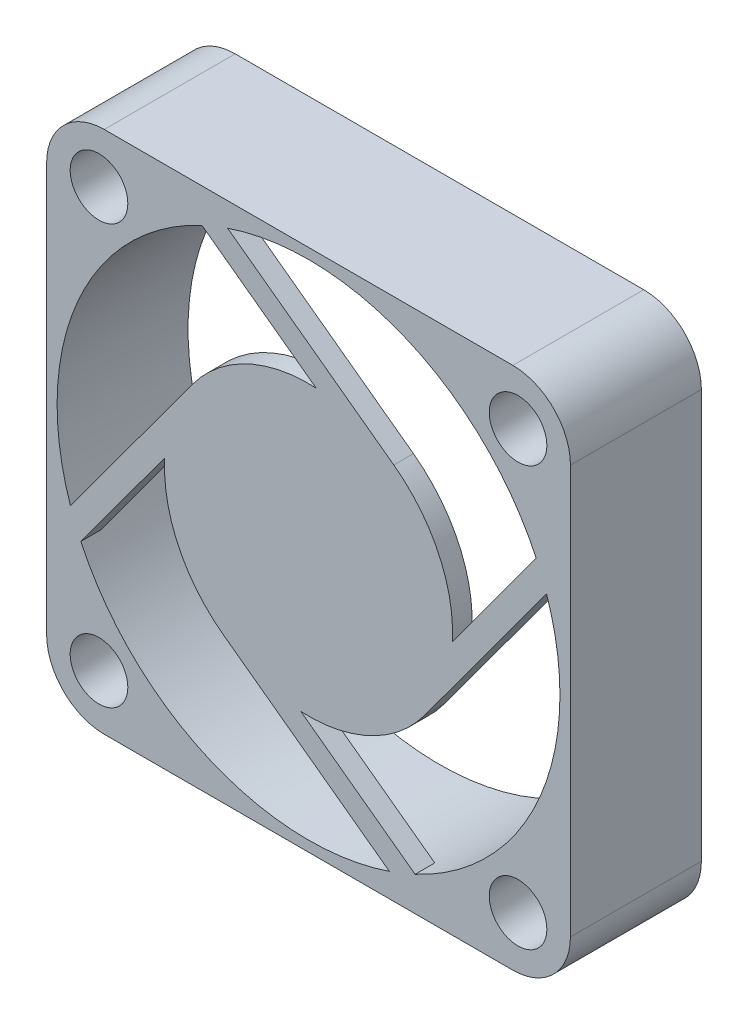
ISO-10303-21;
HEADER;
FILE_DESCRIPTION(('STEP AP214'),'2;1');
FILE_NAME('part.step','',(''),(''),'','','');
FILE_SCHEMA(('AUTOMOTIVE_DESIGN { 1 0 10303 214 1 1 1 1 }'));
ENDSEC;
DATA;
#1=APPLICATION_CONTEXT('core data for automotive mechanical design processes');
#2=APPLICATION_PROTOCOL_DEFINITION('international standard','automotive_design',2000,#1);
#3=PRODUCT_CONTEXT('',#1,'mechanical');
#4=PRODUCT('Part','Part','',(#3));
#5=PRODUCT_RELATED_PRODUCT_CATEGORY('part','',(#4));
#6=PRODUCT_DEFINITION_FORMATION('','',#4);
#7=PRODUCT_DEFINITION_CONTEXT('part definition',#1,'design');
#8=PRODUCT_DEFINITION('design','',#6,#7);
#9=PRODUCT_DEFINITION_SHAPE('','',#8);
#10=(LENGTH_UNIT() NAMED_UNIT(*) SI_UNIT(.MILLI.,.METRE.));
#11=(NAMED_UNIT(*) PLANE_ANGLE_UNIT() SI_UNIT($,.RADIAN.));
#12=(NAMED_UNIT(*) SI_UNIT($,.STERADIAN.) SOLID_ANGLE_UNIT());
#13=UNCERTAINTY_MEASURE_WITH_UNIT(LENGTH_MEASURE(1.E-05),#10,'distance_accuracy_value','');
#14=(GEOMETRIC_REPRESENTATION_CONTEXT(3) GLOBAL_UNCERTAINTY_ASSIGNED_CONTEXT((#13)) GLOBAL_UNIT_ASSIGNED_CONTEXT((#10,
#11,#12)) REPRESENTATION_CONTEXT('',''));
#15=CARTESIAN_POINT('',(0.,0.,0.));
#16=DIRECTION('',(0.,0.,1.));
#17=DIRECTION('',(1.,0.,0.));
#18=AXIS2_PLACEMENT_3D('',#15,#16,#17);
#19=CARTESIAN_POINT('',(-20.,20.,10.));
#20=DIRECTION('',(1.,0.,0.));
#21=DIRECTION('',(0.,1.,0.));
#22=AXIS2_PLACEMENT_3D('',#19,#20,#21);
#23=PLANE('',#22);
#24=DIRECTION('',(0.,-1.,0.));
#25=VECTOR('',#24,1.);
#26=CARTESIAN_POINT('',(-20.,20.,0.));
#27=LINE('',#26,#25);
#28=CARTESIAN_POINT('',(-20.,15.6,0.));
#29=VERTEX_POINT('',#28);
#30=CARTESIAN_POINT('',(-20.,-15.6,0.));
#31=VERTEX_POINT('',#30);
#32=EDGE_CURVE('E421',#29,#31,#27,.T.);
#33=ORIENTED_EDGE('',*,*,#32,.T.);
#34=DIRECTION('',(0.,0.,-1.));
#35=VECTOR('',#34,1.);
#36=CARTESIAN_POINT('',(-20.,-15.6,10.));
#37=LINE('',#36,#35);
#38=CARTESIAN_POINT('',(-20.,-15.6,10.));
#39=VERTEX_POINT('',#38);
#40=EDGE_CURVE('E489',#31,#39,#37,.F.);
#41=ORIENTED_EDGE('',*,*,#40,.T.);
#42=DIRECTION('',(0.,-1.,0.));
#43=VECTOR('',#42,1.);
#44=CARTESIAN_POINT('',(-20.,20.,10.));
#45=LINE('',#44,#43);
#46=CARTESIAN_POINT('',(-20.,15.6,10.));
#47=VERTEX_POINT('',#46);
#48=EDGE_CURVE('E425',#47,#39,#45,.T.);
#49=ORIENTED_EDGE('',*,*,#48,.F.);
#50=DIRECTION('',(0.,0.,-1.));
#51=VECTOR('',#50,1.);
#52=CARTESIAN_POINT('',(-20.,15.6,10.));
#53=LINE('',#52,#51);
#54=EDGE_CURVE('E485',#47,#29,#53,.T.);
#55=ORIENTED_EDGE('',*,*,#54,.T.);
#56=EDGE_LOOP('',(#33,#41,#49,#55));
#57=FACE_BOUND('',#56,.T.);
#58=ADVANCED_FACE('F40',(#57),#23,.F.);
#59=CARTESIAN_POINT('',(20.,-20.,10.));
#60=DIRECTION('',(0.,1.,0.));
#61=DIRECTION('',(-1.,0.,0.));
#62=AXIS2_PLACEMENT_3D('',#59,#60,#61);
#63=PLANE('',#62);
#64=DIRECTION('',(1.,0.,0.));
#65=VECTOR('',#64,1.);
#66=CARTESIAN_POINT('',(20.,-20.,0.));
#67=LINE('',#66,#65);
#68=CARTESIAN_POINT('',(-15.6,-20.,0.));
#69=VERTEX_POINT('',#68);
#70=CARTESIAN_POINT('',(15.6,-20.,0.));
#71=VERTEX_POINT('',#70);
#72=EDGE_CURVE('E445',#69,#71,#67,.T.);
#73=ORIENTED_EDGE('',*,*,#72,.T.);
#74=DIRECTION('',(0.,0.,-1.));
#75=VECTOR('',#74,1.);
#76=CARTESIAN_POINT('',(15.6,-20.,10.));
#77=LINE('',#76,#75);
#78=CARTESIAN_POINT('',(15.6,-20.,10.));
#79=VERTEX_POINT('',#78);
#80=EDGE_CURVE('E473',#71,#79,#77,.F.);
#81=ORIENTED_EDGE('',*,*,#80,.T.);
#82=DIRECTION('',(1.,0.,0.));
#83=VECTOR('',#82,1.);
#84=CARTESIAN_POINT('',(20.,-20.,10.));
#85=LINE('',#84,#83);
#86=CARTESIAN_POINT('',(-15.6,-20.,10.));
#87=VERTEX_POINT('',#86);
#88=EDGE_CURVE('E429',#87,#79,#85,.T.);
#89=ORIENTED_EDGE('',*,*,#88,.F.);
#90=DIRECTION('',(0.,0.,-1.));
#91=VECTOR('',#90,1.);
#92=CARTESIAN_POINT('',(-15.6,-20.,10.));
#93=LINE('',#92,#91);
#94=EDGE_CURVE('E470',#87,#69,#93,.T.);
#95=ORIENTED_EDGE('',*,*,#94,.T.);
#96=EDGE_LOOP('',(#73,#81,#89,#95));
#97=FACE_BOUND('',#96,.T.);
#98=ADVANCED_FACE('F520',(#97),#63,.F.);
#99=CARTESIAN_POINT('',(20.,20.,10.));
#100=DIRECTION('',(-1.,0.,0.));
#101=DIRECTION('',(0.,-1.,0.));
#102=AXIS2_PLACEMENT_3D('',#99,#100,#101);
#103=PLANE('',#102);
#104=DIRECTION('',(0.,1.,0.));
#105=VECTOR('',#104,1.);
#106=CARTESIAN_POINT('',(20.,20.,10.));
#107=LINE('',#106,#105);
#108=CARTESIAN_POINT('',(20.,-15.6,10.));
#109=VERTEX_POINT('',#108);
#110=CARTESIAN_POINT('',(20.,15.6,10.));
#111=VERTEX_POINT('',#110);
#112=EDGE_CURVE('E433',#109,#111,#107,.T.);
#113=ORIENTED_EDGE('',*,*,#112,.F.);
#114=DIRECTION('',(0.,0.,-1.));
#115=VECTOR('',#114,1.);
#116=CARTESIAN_POINT('',(20.,-15.6,10.));
#117=LINE('',#116,#115);
#118=CARTESIAN_POINT('',(20.,-15.6,0.));
#119=VERTEX_POINT('',#118);
#120=EDGE_CURVE('E457',#109,#119,#117,.T.);
#121=ORIENTED_EDGE('',*,*,#120,.T.);
#122=DIRECTION('',(0.,1.,0.));
#123=VECTOR('',#122,1.);
#124=CARTESIAN_POINT('',(20.,20.,0.));
#125=LINE('',#124,#123);
#126=CARTESIAN_POINT('',(20.,15.6,0.));
#127=VERTEX_POINT('',#126);
#128=EDGE_CURVE('E448',#119,#127,#125,.T.);
#129=ORIENTED_EDGE('',*,*,#128,.T.);
#130=DIRECTION('',(0.,0.,-1.));
#131=VECTOR('',#130,1.);
#132=CARTESIAN_POINT('',(20.,15.6,10.));
#133=LINE('',#132,#131);
#134=EDGE_CURVE('E441',#127,#111,#133,.F.);
#135=ORIENTED_EDGE('',*,*,#134,.T.);
#136=EDGE_LOOP('',(#113,#121,#129,#135));
#137=FACE_BOUND('',#136,.T.);
#138=ADVANCED_FACE('F528',(#137),#103,.F.);
#139=CARTESIAN_POINT('',(20.,20.,10.));
#140=DIRECTION('',(0.,-1.,0.));
#141=DIRECTION('',(1.,0.,0.));
#142=AXIS2_PLACEMENT_3D('',#139,#140,#141);
#143=PLANE('',#142);
#144=DIRECTION('',(-1.,0.,0.));
#145=VECTOR('',#144,1.);
#146=CARTESIAN_POINT('',(20.,20.,0.));
#147=LINE('',#146,#145);
#148=CARTESIAN_POINT('',(15.6,20.,0.));
#149=VERTEX_POINT('',#148);
#150=CARTESIAN_POINT('',(-15.6,20.,0.));
#151=VERTEX_POINT('',#150);
#152=EDGE_CURVE('E430',#149,#151,#147,.T.);
#153=ORIENTED_EDGE('',*,*,#152,.T.);
#154=DIRECTION('',(0.,0.,-1.));
#155=VECTOR('',#154,1.);
#156=CARTESIAN_POINT('',(-15.6,20.,10.));
#157=LINE('',#156,#155);
#158=CARTESIAN_POINT('',(-15.6,20.,10.));
#159=VERTEX_POINT('',#158);
#160=EDGE_CURVE('E11',#151,#159,#157,.F.);
#161=ORIENTED_EDGE('',*,*,#160,.T.);
#162=DIRECTION('',(-1.,0.,0.));
#163=VECTOR('',#162,1.);
#164=CARTESIAN_POINT('',(20.,20.,10.));
#165=LINE('',#164,#163);
#166=CARTESIAN_POINT('',(15.6,20.,10.));
#167=VERTEX_POINT('',#166);
#168=EDGE_CURVE('E437',#167,#159,#165,.T.);
#169=ORIENTED_EDGE('',*,*,#168,.F.);
#170=DIRECTION('',(0.,0.,-1.));
#171=VECTOR('',#170,1.);
#172=CARTESIAN_POINT('',(15.6,20.,10.));
#173=LINE('',#172,#171);
#174=EDGE_CURVE('E49',#167,#149,#173,.T.);
#175=ORIENTED_EDGE('',*,*,#174,.T.);
#176=EDGE_LOOP('',(#153,#161,#169,#175));
#177=FACE_BOUND('',#176,.T.);
#178=ADVANCED_FACE('F496',(#177),#143,.F.);
#179=CARTESIAN_POINT('',(-20.,-20.,10.));
#180=DIRECTION('',(0.,0.,-1.));
#181=DIRECTION('',(-1.,0.,0.));
#182=AXIS2_PLACEMENT_3D('',#179,#180,#181);
#183=PLANE('',#182);
#184=CARTESIAN_POINT('',(0.,0.,10.));
#185=DIRECTION('',(0.,0.,1.));
#186=DIRECTION('',(1.,0.,0.));
#187=AXIS2_PLACEMENT_3D('',#184,#185,#186);
#188=CIRCLE('',#187,19.2);
#189=CARTESIAN_POINT('',(8.13981859572141,-17.3891734486935,10.));
#190=VERTEX_POINT('',#189);
#191=CARTESIAN_POINT('',(18.1798437537984,6.17521506406682,10.));
#192=VERTEX_POINT('',#191);
#193=EDGE_CURVE('E344',#190,#192,#188,.T.);
#194=ORIENTED_EDGE('',*,*,#193,.F.);
#195=DIRECTION('',(-0.806084681412893,0.5918002081712,0.));
#196=VECTOR('',#195,1.);
#197=CARTESIAN_POINT('',(-0.583931442200631,-10.984490159803,10.));
#198=LINE('',#197,#196);
#199=CARTESIAN_POINT('',(-0.583931442200632,-10.984490159803,10.));
#200=VERTEX_POINT('',#199);
#201=EDGE_CURVE('E309',#190,#200,#198,.T.);
#202=ORIENTED_EDGE('',*,*,#201,.T.);
#203=CARTESIAN_POINT('',(0.,0.,10.));
#204=DIRECTION('',(0.,0.,1.));
#205=DIRECTION('',(1.,0.,0.));
#206=AXIS2_PLACEMENT_3D('',#203,#204,#205);
#207=CIRCLE('',#206,11.);
#208=CARTESIAN_POINT('',(8.8669314955418,-6.50980228988323,10.));
#209=VERTEX_POINT('',#208);
#210=EDGE_CURVE('E312',#200,#209,#207,.T.);
#211=ORIENTED_EDGE('',*,*,#210,.T.);
#212=DIRECTION('',(0.591800208171203,0.80608468141289,0.));
#213=VECTOR('',#212,1.);
#214=CARTESIAN_POINT('',(8.8669314955418,-6.50980228988323,10.));
#215=LINE('',#214,#213);
#216=EDGE_CURVE('E315',#209,#192,#215,.T.);
#217=ORIENTED_EDGE('',*,*,#216,.T.);
#218=EDGE_LOOP('',(#194,#202,#211,#217));
#219=FACE_BOUND('',#218,.T.);
#220=CARTESIAN_POINT('',(-17.3891734486935,-8.1398185957214,10.));
#221=VERTEX_POINT('',#220);
#222=CARTESIAN_POINT('',(6.17521506406676,-18.1798437537984,10.));
#223=VERTEX_POINT('',#222);
#224=EDGE_CURVE('E396',#221,#223,#188,.T.);
#225=ORIENTED_EDGE('',*,*,#224,.F.);
#226=DIRECTION('',(0.5918002081712,0.806084681412893,0.));
#227=VECTOR('',#226,1.);
#228=CARTESIAN_POINT('',(-10.984490159803,0.583931442200646,10.));
#229=LINE('',#228,#227);
#230=CARTESIAN_POINT('',(-10.984490159803,0.583931442200646,10.));
#231=VERTEX_POINT('',#230);
#232=EDGE_CURVE('E252',#221,#231,#229,.T.);
#233=ORIENTED_EDGE('',*,*,#232,.T.);
#234=CARTESIAN_POINT('',(0.,0.,10.));
#235=DIRECTION('',(0.,0.,1.));
#236=DIRECTION('',(1.,0.,0.));
#237=AXIS2_PLACEMENT_3D('',#234,#235,#236);
#238=CIRCLE('',#237,11.);
#239=CARTESIAN_POINT('',(-6.50980228988326,-8.86693149554177,10.));
#240=VERTEX_POINT('',#239);
#241=EDGE_CURVE('E306',#231,#240,#238,.T.);
#242=ORIENTED_EDGE('',*,*,#241,.T.);
#243=DIRECTION('',(0.806084681412888,-0.591800208171206,0.));
#244=VECTOR('',#243,1.);
#245=CARTESIAN_POINT('',(-6.50980228988326,-8.86693149554177,10.));
#246=LINE('',#245,#244);
#247=EDGE_CURVE('E234',#240,#223,#246,.T.);
#248=ORIENTED_EDGE('',*,*,#247,.T.);
#249=EDGE_LOOP('',(#225,#233,#242,#248));
#250=FACE_BOUND('',#249,.T.);
#251=CARTESIAN_POINT('',(-8.13981859572126,17.3891734486936,10.));
#252=VERTEX_POINT('',#251);
#253=CARTESIAN_POINT('',(-18.1798437537984,-6.17521506406669,10.));
#254=VERTEX_POINT('',#253);
#255=EDGE_CURVE('E826',#252,#254,#188,.T.);
#256=ORIENTED_EDGE('',*,*,#255,.F.);
#257=DIRECTION('',(0.806084681412886,-0.591800208171208,0.));
#258=VECTOR('',#257,1.);
#259=CARTESIAN_POINT('',(0.583931442200696,10.984490159803,10.));
#260=LINE('',#259,#258);
#261=CARTESIAN_POINT('',(0.583931442200694,10.984490159803,10.));
#262=VERTEX_POINT('',#261);
#263=EDGE_CURVE('E331',#252,#262,#260,.T.);
#264=ORIENTED_EDGE('',*,*,#263,.T.);
#265=CARTESIAN_POINT('',(0.,0.,10.));
#266=DIRECTION('',(0.,0.,1.));
#267=DIRECTION('',(1.,0.,0.));
#268=AXIS2_PLACEMENT_3D('',#265,#266,#267);
#269=CIRCLE('',#268,11.);
#270=CARTESIAN_POINT('',(-8.86693149554175,6.50980228988329,10.));
#271=VERTEX_POINT('',#270);
#272=EDGE_CURVE('E335',#262,#271,#269,.T.);
#273=ORIENTED_EDGE('',*,*,#272,.T.);
#274=DIRECTION('',(-0.591800208171208,-0.806084681412886,0.));
#275=VECTOR('',#274,1.);
#276=CARTESIAN_POINT('',(-8.86693149554175,6.50980228988329,10.));
#277=LINE('',#276,#275);
#278=EDGE_CURVE('E258',#271,#254,#277,.T.);
#279=ORIENTED_EDGE('',*,*,#278,.T.);
#280=EDGE_LOOP('',(#256,#264,#273,#279));
#281=FACE_BOUND('',#280,.T.);
#282=CARTESIAN_POINT('',(17.3891734486936,8.13981859572132,10.));
#283=VERTEX_POINT('',#282);
#284=CARTESIAN_POINT('',(-6.17521506406688,18.1798437537984,10.));
#285=VERTEX_POINT('',#284);
#286=EDGE_CURVE('E393',#283,#285,#188,.T.);
#287=ORIENTED_EDGE('',*,*,#286,.F.);
#288=DIRECTION('',(-0.5918002081712,-0.806084681412892,0.));
#289=VECTOR('',#288,1.);
#290=CARTESIAN_POINT('',(10.984490159803,-0.583931442200781,10.));
#291=LINE('',#290,#289);
#292=CARTESIAN_POINT('',(10.984490159803,-0.583931442200779,10.));
#293=VERTEX_POINT('',#292);
#294=EDGE_CURVE('E319',#283,#293,#291,.T.);
#295=ORIENTED_EDGE('',*,*,#294,.T.);
#296=CARTESIAN_POINT('',(0.,0.,10.));
#297=DIRECTION('',(0.,0.,1.));
#298=DIRECTION('',(1.,0.,0.));
#299=AXIS2_PLACEMENT_3D('',#296,#297,#298);
#300=CIRCLE('',#299,11.);
#301=CARTESIAN_POINT('',(6.5098022898832,8.86693149554182,10.));
#302=VERTEX_POINT('',#301);
#303=EDGE_CURVE('E323',#293,#302,#300,.T.);
#304=ORIENTED_EDGE('',*,*,#303,.T.);
#305=DIRECTION('',(-0.806084681412893,0.5918002081712,0.));
#306=VECTOR('',#305,1.);
#307=CARTESIAN_POINT('',(6.5098022898832,8.86693149554182,10.));
#308=LINE('',#307,#306);
#309=EDGE_CURVE('E327',#302,#285,#308,.T.);
#310=ORIENTED_EDGE('',*,*,#309,.T.);
#311=EDGE_LOOP('',(#287,#295,#304,#310));
#312=FACE_BOUND('',#311,.T.);
#313=CARTESIAN_POINT('',(-16.,-16.,10.));
#314=DIRECTION('',(0.,0.,1.));
#315=DIRECTION('',(1.,0.,0.));
#316=AXIS2_PLACEMENT_3D('',#313,#314,#315);
#317=CIRCLE('',#316,2.2);
#318=CARTESIAN_POINT('',(-13.8,-16.,10.));
#319=VERTEX_POINT('',#318);
#320=EDGE_CURVE('E392',#319,#319,#317,.T.);
#321=ORIENTED_EDGE('',*,*,#320,.F.);
#322=EDGE_LOOP('',(#321));
#323=FACE_BOUND('',#322,.T.);
#324=CARTESIAN_POINT('',(16.,-16.,10.));
#325=DIRECTION('',(0.,0.,1.));
#326=DIRECTION('',(1.,0.,0.));
#327=AXIS2_PLACEMENT_3D('',#324,#325,#326);
#328=CIRCLE('',#327,2.2);
#329=CARTESIAN_POINT('',(18.2,-16.,10.));
#330=VERTEX_POINT('',#329);
#331=EDGE_CURVE('E400',#330,#330,#328,.T.);
#332=ORIENTED_EDGE('',*,*,#331,.F.);
#333=EDGE_LOOP('',(#332));
#334=FACE_BOUND('',#333,.T.);
#335=CARTESIAN_POINT('',(16.,16.,10.));
#336=DIRECTION('',(0.,0.,1.));
#337=DIRECTION('',(1.,0.,0.));
#338=AXIS2_PLACEMENT_3D('',#335,#336,#337);
#339=CIRCLE('',#338,2.2);
#340=CARTESIAN_POINT('',(18.2,16.,10.));
#341=VERTEX_POINT('',#340);
#342=EDGE_CURVE('E406',#341,#341,#339,.T.);
#343=ORIENTED_EDGE('',*,*,#342,.F.);
#344=EDGE_LOOP('',(#343));
#345=FACE_BOUND('',#344,.T.);
#346=CARTESIAN_POINT('',(-16.,16.,10.));
#347=DIRECTION('',(0.,0.,1.));
#348=DIRECTION('',(1.,0.,0.));
#349=AXIS2_PLACEMENT_3D('',#346,#347,#348);
#350=CIRCLE('',#349,2.2);
#351=CARTESIAN_POINT('',(-13.8,16.,10.));
#352=VERTEX_POINT('',#351);
#353=EDGE_CURVE('E413',#352,#352,#350,.T.);
#354=ORIENTED_EDGE('',*,*,#353,.F.);
#355=EDGE_LOOP('',(#354));
#356=FACE_BOUND('',#355,.T.);
#357=ORIENTED_EDGE('',*,*,#88,.T.);
#358=CARTESIAN_POINT('',(15.6,-15.6,10.));
#359=DIRECTION('',(0.,0.,-1.));
#360=DIRECTION('',(-1.,0.,0.));
#361=AXIS2_PLACEMENT_3D('',#358,#359,#360);
#362=CIRCLE('',#361,4.4);
#363=EDGE_CURVE('E483',#79,#109,#362,.F.);
#364=ORIENTED_EDGE('',*,*,#363,.T.);
#365=ORIENTED_EDGE('',*,*,#112,.T.);
#366=CARTESIAN_POINT('',(15.6,15.6,10.));
#367=DIRECTION('',(0.,0.,-1.));
#368=DIRECTION('',(-1.,0.,0.));
#369=AXIS2_PLACEMENT_3D('',#366,#367,#368);
#370=CIRCLE('',#369,4.4);
#371=EDGE_CURVE('E475',#111,#167,#370,.F.);
#372=ORIENTED_EDGE('',*,*,#371,.T.);
#373=ORIENTED_EDGE('',*,*,#168,.T.);
#374=CARTESIAN_POINT('',(-15.6,15.6,10.));
#375=DIRECTION('',(0.,0.,-1.));
#376=DIRECTION('',(-1.,0.,0.));
#377=AXIS2_PLACEMENT_3D('',#374,#375,#376);
#378=CIRCLE('',#377,4.4);
#379=EDGE_CURVE('E478',#159,#47,#378,.F.);
#380=ORIENTED_EDGE('',*,*,#379,.T.);
#381=ORIENTED_EDGE('',*,*,#48,.T.);
#382=CARTESIAN_POINT('',(-15.6,-15.6,10.));
#383=DIRECTION('',(0.,0.,-1.));
#384=DIRECTION('',(-1.,0.,0.));
#385=AXIS2_PLACEMENT_3D('',#382,#383,#384);
#386=CIRCLE('',#385,4.4);
#387=EDGE_CURVE('E481',#39,#87,#386,.F.);
#388=ORIENTED_EDGE('',*,*,#387,.T.);
#389=EDGE_LOOP('',(#357,#364,#365,#372,#373,#380,#381,#388));
#390=FACE_BOUND('',#389,.T.);
#391=ADVANCED_FACE('F513',(#219,#250,#281,#312,#323,#334,#345,#356,#390),#183,.F.);
#392=CARTESIAN_POINT('',(-20.,-20.,0.));
#393=DIRECTION('',(0.,0.,-1.));
#394=DIRECTION('',(-1.,0.,0.));
#395=AXIS2_PLACEMENT_3D('',#392,#393,#394);
#396=PLANE('',#395);
#397=CARTESIAN_POINT('',(0.,0.,0.));
#398=DIRECTION('',(0.,0.,1.));
#399=DIRECTION('',(1.,0.,0.));
#400=AXIS2_PLACEMENT_3D('',#397,#398,#399);
#401=CIRCLE('',#400,19.2);
#402=CARTESIAN_POINT('',(19.2,0.,0.));
#403=VERTEX_POINT('',#402);
#404=EDGE_CURVE('E388',#403,#403,#401,.T.);
#405=ORIENTED_EDGE('',*,*,#404,.T.);
#406=EDGE_LOOP('',(#405));
#407=FACE_BOUND('',#406,.T.);
#408=CARTESIAN_POINT('',(-16.,-16.,0.));
#409=DIRECTION('',(0.,0.,1.));
#410=DIRECTION('',(1.,0.,0.));
#411=AXIS2_PLACEMENT_3D('',#408,#409,#410);
#412=CIRCLE('',#411,2.2);
#413=CARTESIAN_POINT('',(-13.8,-16.,0.));
#414=VERTEX_POINT('',#413);
#415=EDGE_CURVE('E397',#414,#414,#412,.T.);
#416=ORIENTED_EDGE('',*,*,#415,.T.);
#417=EDGE_LOOP('',(#416));
#418=FACE_BOUND('',#417,.T.);
#419=CARTESIAN_POINT('',(16.,-16.,0.));
#420=DIRECTION('',(0.,0.,1.));
#421=DIRECTION('',(1.,0.,0.));
#422=AXIS2_PLACEMENT_3D('',#419,#420,#421);
#423=CIRCLE('',#422,2.2);
#424=CARTESIAN_POINT('',(18.2,-16.,0.));
#425=VERTEX_POINT('',#424);
#426=EDGE_CURVE('E403',#425,#425,#423,.T.);
#427=ORIENTED_EDGE('',*,*,#426,.T.);
#428=EDGE_LOOP('',(#427));
#429=FACE_BOUND('',#428,.T.);
#430=CARTESIAN_POINT('',(16.,16.,0.));
#431=DIRECTION('',(0.,0.,1.));
#432=DIRECTION('',(1.,0.,0.));
#433=AXIS2_PLACEMENT_3D('',#430,#431,#432);
#434=CIRCLE('',#433,2.2);
#435=CARTESIAN_POINT('',(18.2,16.,0.));
#436=VERTEX_POINT('',#435);
#437=EDGE_CURVE('E409',#436,#436,#434,.T.);
#438=ORIENTED_EDGE('',*,*,#437,.T.);
#439=EDGE_LOOP('',(#438));
#440=FACE_BOUND('',#439,.T.);
#441=CARTESIAN_POINT('',(-16.,16.,0.));
#442=DIRECTION('',(0.,0.,1.));
#443=DIRECTION('',(1.,0.,0.));
#444=AXIS2_PLACEMENT_3D('',#441,#442,#443);
#445=CIRCLE('',#444,2.2);
#446=CARTESIAN_POINT('',(-13.8,16.,0.));
#447=VERTEX_POINT('',#446);
#448=EDGE_CURVE('E417',#447,#447,#445,.T.);
#449=ORIENTED_EDGE('',*,*,#448,.T.);
#450=EDGE_LOOP('',(#449));
#451=FACE_BOUND('',#450,.T.);
#452=ORIENTED_EDGE('',*,*,#128,.F.);
#453=CARTESIAN_POINT('',(15.6,-15.6,0.));
#454=DIRECTION('',(0.,0.,-1.));
#455=DIRECTION('',(-1.,0.,0.));
#456=AXIS2_PLACEMENT_3D('',#453,#454,#455);
#457=CIRCLE('',#456,4.4);
#458=EDGE_CURVE('E468',#119,#71,#457,.T.);
#459=ORIENTED_EDGE('',*,*,#458,.T.);
#460=ORIENTED_EDGE('',*,*,#72,.F.);
#461=CARTESIAN_POINT('',(-15.6,-15.6,0.));
#462=DIRECTION('',(0.,0.,-1.));
#463=DIRECTION('',(-1.,0.,0.));
#464=AXIS2_PLACEMENT_3D('',#461,#462,#463);
#465=CIRCLE('',#464,4.4);
#466=EDGE_CURVE('E466',#69,#31,#465,.T.);
#467=ORIENTED_EDGE('',*,*,#466,.T.);
#468=ORIENTED_EDGE('',*,*,#32,.F.);
#469=CARTESIAN_POINT('',(-15.6,15.6,0.));
#470=DIRECTION('',(0.,0.,-1.));
#471=DIRECTION('',(-1.,0.,0.));
#472=AXIS2_PLACEMENT_3D('',#469,#470,#471);
#473=CIRCLE('',#472,4.4);
#474=EDGE_CURVE('E463',#29,#151,#473,.T.);
#475=ORIENTED_EDGE('',*,*,#474,.T.);
#476=ORIENTED_EDGE('',*,*,#152,.F.);
#477=CARTESIAN_POINT('',(15.6,15.6,0.));
#478=DIRECTION('',(0.,0.,-1.));
#479=DIRECTION('',(-1.,0.,0.));
#480=AXIS2_PLACEMENT_3D('',#477,#478,#479);
#481=CIRCLE('',#480,4.4);
#482=EDGE_CURVE('E460',#149,#127,#481,.T.);
#483=ORIENTED_EDGE('',*,*,#482,.T.);
#484=EDGE_LOOP('',(#452,#459,#460,#467,#468,#475,#476,#483));
#485=FACE_BOUND('',#484,.T.);
#486=ADVANCED_FACE('F502',(#407,#418,#429,#440,#451,#485),#396,.T.);
#487=CARTESIAN_POINT('',(-16.,16.,0.));
#488=DIRECTION('',(0.,0.,1.));
#489=DIRECTION('',(1.,0.,0.));
#490=AXIS2_PLACEMENT_3D('',#487,#488,#489);
#491=CYLINDRICAL_SURFACE('',#490,2.2);
#492=ORIENTED_EDGE('',*,*,#448,.F.);
#493=EDGE_LOOP('',(#492));
#494=FACE_BOUND('',#493,.T.);
#495=ORIENTED_EDGE('',*,*,#353,.T.);
#496=EDGE_LOOP('',(#495));
#497=FACE_BOUND('',#496,.T.);
#498=ADVANCED_FACE('F722',(#494,#497),#491,.F.);
#499=CARTESIAN_POINT('',(16.,16.,0.));
#500=DIRECTION('',(0.,0.,1.));
#501=DIRECTION('',(1.,0.,0.));
#502=AXIS2_PLACEMENT_3D('',#499,#500,#501);
#503=CYLINDRICAL_SURFACE('',#502,2.2);
#504=ORIENTED_EDGE('',*,*,#437,.F.);
#505=EDGE_LOOP('',(#504));
#506=FACE_BOUND('',#505,.T.);
#507=ORIENTED_EDGE('',*,*,#342,.T.);
#508=EDGE_LOOP('',(#507));
#509=FACE_BOUND('',#508,.T.);
#510=ADVANCED_FACE('F718',(#506,#509),#503,.F.);
#511=CARTESIAN_POINT('',(16.,-16.,0.));
#512=DIRECTION('',(0.,0.,1.));
#513=DIRECTION('',(1.,0.,0.));
#514=AXIS2_PLACEMENT_3D('',#511,#512,#513);
#515=CYLINDRICAL_SURFACE('',#514,2.2);
#516=ORIENTED_EDGE('',*,*,#426,.F.);
#517=EDGE_LOOP('',(#516));
#518=FACE_BOUND('',#517,.T.);
#519=ORIENTED_EDGE('',*,*,#331,.T.);
#520=EDGE_LOOP('',(#519));
#521=FACE_BOUND('',#520,.T.);
#522=ADVANCED_FACE('F714',(#518,#521),#515,.F.);
#523=CARTESIAN_POINT('',(-16.,-16.,0.));
#524=DIRECTION('',(0.,0.,1.));
#525=DIRECTION('',(1.,0.,0.));
#526=AXIS2_PLACEMENT_3D('',#523,#524,#525);
#527=CYLINDRICAL_SURFACE('',#526,2.2);
#528=ORIENTED_EDGE('',*,*,#415,.F.);
#529=EDGE_LOOP('',(#528));
#530=FACE_BOUND('',#529,.T.);
#531=ORIENTED_EDGE('',*,*,#320,.T.);
#532=EDGE_LOOP('',(#531));
#533=FACE_BOUND('',#532,.T.);
#534=ADVANCED_FACE('F585',(#530,#533),#527,.F.);
#535=CARTESIAN_POINT('',(0.,0.,0.));
#536=DIRECTION('',(0.,0.,1.));
#537=DIRECTION('',(1.,0.,0.));
#538=AXIS2_PLACEMENT_3D('',#535,#536,#537);
#539=CYLINDRICAL_SURFACE('',#538,19.2);
#540=ORIENTED_EDGE('',*,*,#404,.F.);
#541=EDGE_LOOP('',(#540));
#542=FACE_BOUND('',#541,.T.);
#543=CARTESIAN_POINT('',(0.,0.,8.5));
#544=DIRECTION('',(0.,0.,1.));
#545=DIRECTION('',(1.,0.,0.));
#546=AXIS2_PLACEMENT_3D('',#543,#544,#545);
#547=CIRCLE('',#546,19.2);
#548=CARTESIAN_POINT('',(6.17521506406676,-18.1798437537984,8.5));
#549=VERTEX_POINT('',#548);
#550=CARTESIAN_POINT('',(8.13981859572141,-17.3891734486935,8.5));
#551=VERTEX_POINT('',#550);
#552=EDGE_CURVE('E60',#549,#551,#547,.T.);
#553=ORIENTED_EDGE('',*,*,#552,.T.);
#554=DIRECTION('',(0.,0.,1.));
#555=VECTOR('',#554,1.);
#556=CARTESIAN_POINT('',(8.13981859572141,-17.3891734486935,8.5));
#557=LINE('',#556,#555);
#558=EDGE_CURVE('E385',#551,#190,#557,.T.);
#559=ORIENTED_EDGE('',*,*,#558,.T.);
#560=ORIENTED_EDGE('',*,*,#193,.T.);
#561=DIRECTION('',(0.,0.,1.));
#562=VECTOR('',#561,1.);
#563=CARTESIAN_POINT('',(18.1798437537984,6.17521506406682,8.5));
#564=LINE('',#563,#562);
#565=CARTESIAN_POINT('',(18.1798437537984,6.17521506406682,8.5));
#566=VERTEX_POINT('',#565);
#567=EDGE_CURVE('E377',#566,#192,#564,.T.);
#568=ORIENTED_EDGE('',*,*,#567,.F.);
#569=CARTESIAN_POINT('',(0.,0.,8.5));
#570=DIRECTION('',(0.,0.,1.));
#571=DIRECTION('',(1.,0.,0.));
#572=AXIS2_PLACEMENT_3D('',#569,#570,#571);
#573=CIRCLE('',#572,19.2);
#574=CARTESIAN_POINT('',(17.3891734486936,8.13981859572132,8.5));
#575=VERTEX_POINT('',#574);
#576=EDGE_CURVE('E272',#566,#575,#573,.T.);
#577=ORIENTED_EDGE('',*,*,#576,.T.);
#578=DIRECTION('',(0.,0.,1.));
#579=VECTOR('',#578,1.);
#580=CARTESIAN_POINT('',(17.3891734486936,8.13981859572132,8.5));
#581=LINE('',#580,#579);
#582=EDGE_CURVE('E373',#575,#283,#581,.T.);
#583=ORIENTED_EDGE('',*,*,#582,.T.);
#584=ORIENTED_EDGE('',*,*,#286,.T.);
#585=DIRECTION('',(0.,0.,1.));
#586=VECTOR('',#585,1.);
#587=CARTESIAN_POINT('',(-6.17521506406688,18.1798437537984,8.5));
#588=LINE('',#587,#586);
#589=CARTESIAN_POINT('',(-6.17521506406688,18.1798437537984,8.5));
#590=VERTEX_POINT('',#589);
#591=EDGE_CURVE('E363',#590,#285,#588,.T.);
#592=ORIENTED_EDGE('',*,*,#591,.F.);
#593=CARTESIAN_POINT('',(0.,0.,8.5));
#594=DIRECTION('',(0.,0.,1.));
#595=DIRECTION('',(1.,0.,0.));
#596=AXIS2_PLACEMENT_3D('',#593,#594,#595);
#597=CIRCLE('',#596,19.2);
#598=CARTESIAN_POINT('',(-8.13981859572126,17.3891734486936,8.5));
#599=VERTEX_POINT('',#598);
#600=EDGE_CURVE('E287',#590,#599,#597,.T.);
#601=ORIENTED_EDGE('',*,*,#600,.T.);
#602=DIRECTION('',(0.,0.,1.));
#603=VECTOR('',#602,1.);
#604=CARTESIAN_POINT('',(-8.13981859572126,17.3891734486936,8.5));
#605=LINE('',#604,#603);
#606=EDGE_CURVE('E359',#599,#252,#605,.T.);
#607=ORIENTED_EDGE('',*,*,#606,.T.);
#608=ORIENTED_EDGE('',*,*,#255,.T.);
#609=DIRECTION('',(0.,0.,1.));
#610=VECTOR('',#609,1.);
#611=CARTESIAN_POINT('',(-18.1798437537984,-6.17521506406669,8.5));
#612=LINE('',#611,#610);
#613=CARTESIAN_POINT('',(-18.1798437537984,-6.17521506406669,8.5));
#614=VERTEX_POINT('',#613);
#615=EDGE_CURVE('E349',#614,#254,#612,.T.);
#616=ORIENTED_EDGE('',*,*,#615,.F.);
#617=CARTESIAN_POINT('',(0.,0.,8.5));
#618=DIRECTION('',(0.,0.,1.));
#619=DIRECTION('',(1.,0.,0.));
#620=AXIS2_PLACEMENT_3D('',#617,#618,#619);
#621=CIRCLE('',#620,19.2);
#622=CARTESIAN_POINT('',(-17.3891734486935,-8.1398185957214,8.5));
#623=VERTEX_POINT('',#622);
#624=EDGE_CURVE('E302',#614,#623,#621,.T.);
#625=ORIENTED_EDGE('',*,*,#624,.T.);
#626=DIRECTION('',(0.,0.,1.));
#627=VECTOR('',#626,1.);
#628=CARTESIAN_POINT('',(-17.3891734486935,-8.1398185957214,8.5));
#629=LINE('',#628,#627);
#630=EDGE_CURVE('E345',#623,#221,#629,.T.);
#631=ORIENTED_EDGE('',*,*,#630,.T.);
#632=ORIENTED_EDGE('',*,*,#224,.T.);
#633=DIRECTION('',(0.,0.,1.));
#634=VECTOR('',#633,1.);
#635=CARTESIAN_POINT('',(6.17521506406676,-18.1798437537984,8.5));
#636=LINE('',#635,#634);
#637=EDGE_CURVE('E56',#549,#223,#636,.T.);
#638=ORIENTED_EDGE('',*,*,#637,.F.);
#639=EDGE_LOOP('',(#553,#559,#560,#568,#577,#583,#584,#592,#601,#607,#608,#616,#625,#631,#632,#638));
#640=FACE_BOUND('',#639,.T.);
#641=ADVANCED_FACE('F547',(#542,#640),#539,.F.);
#642=CARTESIAN_POINT('',(15.6,-15.6,10.));
#643=DIRECTION('',(0.,0.,-1.));
#644=DIRECTION('',(-1.,0.,0.));
#645=AXIS2_PLACEMENT_3D('',#642,#643,#644);
#646=CYLINDRICAL_SURFACE('',#645,4.4);
#647=ORIENTED_EDGE('',*,*,#363,.F.);
#648=ORIENTED_EDGE('',*,*,#80,.F.);
#649=ORIENTED_EDGE('',*,*,#458,.F.);
#650=ORIENTED_EDGE('',*,*,#120,.F.);
#651=EDGE_LOOP('',(#647,#648,#649,#650));
#652=FACE_BOUND('',#651,.T.);
#653=ADVANCED_FACE('F525',(#652),#646,.T.);
#654=CARTESIAN_POINT('',(-15.6,-15.6,10.));
#655=DIRECTION('',(0.,0.,-1.));
#656=DIRECTION('',(-1.,0.,0.));
#657=AXIS2_PLACEMENT_3D('',#654,#655,#656);
#658=CYLINDRICAL_SURFACE('',#657,4.4);
#659=ORIENTED_EDGE('',*,*,#387,.F.);
#660=ORIENTED_EDGE('',*,*,#40,.F.);
#661=ORIENTED_EDGE('',*,*,#466,.F.);
#662=ORIENTED_EDGE('',*,*,#94,.F.);
#663=EDGE_LOOP('',(#659,#660,#661,#662));
#664=FACE_BOUND('',#663,.T.);
#665=ADVANCED_FACE('F517',(#664),#658,.T.);
#666=CARTESIAN_POINT('',(-15.6,15.6,10.));
#667=DIRECTION('',(0.,0.,-1.));
#668=DIRECTION('',(-1.,0.,0.));
#669=AXIS2_PLACEMENT_3D('',#666,#667,#668);
#670=CYLINDRICAL_SURFACE('',#669,4.4);
#671=ORIENTED_EDGE('',*,*,#379,.F.);
#672=ORIENTED_EDGE('',*,*,#160,.F.);
#673=ORIENTED_EDGE('',*,*,#474,.F.);
#674=ORIENTED_EDGE('',*,*,#54,.F.);
#675=EDGE_LOOP('',(#671,#672,#673,#674));
#676=FACE_BOUND('',#675,.T.);
#677=ADVANCED_FACE('F507',(#676),#670,.T.);
#678=CARTESIAN_POINT('',(15.6,15.6,10.));
#679=DIRECTION('',(0.,0.,-1.));
#680=DIRECTION('',(-1.,0.,0.));
#681=AXIS2_PLACEMENT_3D('',#678,#679,#680);
#682=CYLINDRICAL_SURFACE('',#681,4.4);
#683=ORIENTED_EDGE('',*,*,#371,.F.);
#684=ORIENTED_EDGE('',*,*,#134,.F.);
#685=ORIENTED_EDGE('',*,*,#482,.F.);
#686=ORIENTED_EDGE('',*,*,#174,.F.);
#687=EDGE_LOOP('',(#683,#684,#685,#686));
#688=FACE_BOUND('',#687,.T.);
#689=ADVANCED_FACE('F42',(#688),#682,.T.);
#690=CARTESIAN_POINT('',(0.,0.,8.5));
#691=DIRECTION('',(0.,0.,1.));
#692=DIRECTION('',(1.,0.,0.));
#693=AXIS2_PLACEMENT_3D('',#690,#691,#692);
#694=CYLINDRICAL_SURFACE('',#693,11.);
#695=ORIENTED_EDGE('',*,*,#241,.F.);
#696=DIRECTION('',(0.,0.,1.));
#697=VECTOR('',#696,1.);
#698=CARTESIAN_POINT('',(-10.984490159803,0.583931442200646,8.5));
#699=LINE('',#698,#697);
#700=CARTESIAN_POINT('',(-10.984490159803,0.583931442200646,8.5));
#701=VERTEX_POINT('',#700);
#702=EDGE_CURVE('E250',#701,#231,#699,.T.);
#703=ORIENTED_EDGE('',*,*,#702,.F.);
#704=CARTESIAN_POINT('',(0.,0.,8.5));
#705=DIRECTION('',(0.,0.,1.));
#706=DIRECTION('',(1.,0.,0.));
#707=AXIS2_PLACEMENT_3D('',#704,#705,#706);
#708=CIRCLE('',#707,11.);
#709=CARTESIAN_POINT('',(-6.50980228988326,-8.86693149554177,8.5));
#710=VERTEX_POINT('',#709);
#711=EDGE_CURVE('E245',#701,#710,#708,.T.);
#712=ORIENTED_EDGE('',*,*,#711,.T.);
#713=DIRECTION('',(0.,0.,1.));
#714=VECTOR('',#713,1.);
#715=CARTESIAN_POINT('',(-6.50980228988326,-8.86693149554177,8.5));
#716=LINE('',#715,#714);
#717=EDGE_CURVE('E229',#710,#240,#716,.T.);
#718=ORIENTED_EDGE('',*,*,#717,.T.);
#719=EDGE_LOOP('',(#695,#703,#712,#718));
#720=FACE_BOUND('',#719,.T.);
#721=ADVANCED_FACE('F249',(#720),#694,.T.);
#722=CARTESIAN_POINT('',(-10.984490159803,0.583931442200646,8.5));
#723=DIRECTION('',(0.806084681412893,-0.5918002081712,0.));
#724=DIRECTION('',(0.5918002081712,0.806084681412893,0.));
#725=AXIS2_PLACEMENT_3D('',#722,#723,#724);
#726=PLANE('',#725);
#727=ORIENTED_EDGE('',*,*,#232,.F.);
#728=ORIENTED_EDGE('',*,*,#630,.F.);
#729=DIRECTION('',(0.5918002081712,0.806084681412893,0.));
#730=VECTOR('',#729,1.);
#731=CARTESIAN_POINT('',(-10.984490159803,0.583931442200646,8.5));
#732=LINE('',#731,#730);
#733=EDGE_CURVE('E239',#623,#701,#732,.T.);
#734=ORIENTED_EDGE('',*,*,#733,.T.);
#735=ORIENTED_EDGE('',*,*,#702,.T.);
#736=EDGE_LOOP('',(#727,#728,#734,#735));
#737=FACE_BOUND('',#736,.T.);
#738=ADVANCED_FACE('F535',(#737),#726,.T.);
#739=CARTESIAN_POINT('',(-8.86693149554175,6.50980228988329,8.5));
#740=DIRECTION('',(-0.806084681412886,0.591800208171208,0.));
#741=DIRECTION('',(-0.591800208171208,-0.806084681412886,0.));
#742=AXIS2_PLACEMENT_3D('',#739,#740,#741);
#743=PLANE('',#742);
#744=ORIENTED_EDGE('',*,*,#278,.F.);
#745=DIRECTION('',(0.,0.,1.));
#746=VECTOR('',#745,1.);
#747=CARTESIAN_POINT('',(-8.86693149554175,6.50980228988329,8.5));
#748=LINE('',#747,#746);
#749=CARTESIAN_POINT('',(-8.86693149554175,6.50980228988329,8.5));
#750=VERTEX_POINT('',#749);
#751=EDGE_CURVE('E353',#750,#271,#748,.T.);
#752=ORIENTED_EDGE('',*,*,#751,.F.);
#753=DIRECTION('',(-0.591800208171208,-0.806084681412886,0.));
#754=VECTOR('',#753,1.);
#755=CARTESIAN_POINT('',(-8.86693149554175,6.50980228988329,8.5));
#756=LINE('',#755,#754);
#757=EDGE_CURVE('E298',#750,#614,#756,.T.);
#758=ORIENTED_EDGE('',*,*,#757,.T.);
#759=ORIENTED_EDGE('',*,*,#615,.T.);
#760=EDGE_LOOP('',(#744,#752,#758,#759));
#761=FACE_BOUND('',#760,.T.);
#762=ADVANCED_FACE('F601',(#761),#743,.T.);
#763=CARTESIAN_POINT('',(0.,0.,8.5));
#764=DIRECTION('',(0.,0.,1.));
#765=DIRECTION('',(1.,0.,0.));
#766=AXIS2_PLACEMENT_3D('',#763,#764,#765);
#767=CYLINDRICAL_SURFACE('',#766,11.);
#768=ORIENTED_EDGE('',*,*,#272,.F.);
#769=DIRECTION('',(0.,0.,1.));
#770=VECTOR('',#769,1.);
#771=CARTESIAN_POINT('',(0.583931442200694,10.984490159803,8.5));
#772=LINE('',#771,#770);
#773=CARTESIAN_POINT('',(0.583931442200694,10.984490159803,8.5));
#774=VERTEX_POINT('',#773);
#775=EDGE_CURVE('E356',#774,#262,#772,.T.);
#776=ORIENTED_EDGE('',*,*,#775,.F.);
#777=CARTESIAN_POINT('',(0.,0.,8.5));
#778=DIRECTION('',(0.,0.,1.));
#779=DIRECTION('',(1.,0.,0.));
#780=AXIS2_PLACEMENT_3D('',#777,#778,#779);
#781=CIRCLE('',#780,11.);
#782=EDGE_CURVE('E294',#774,#750,#781,.T.);
#783=ORIENTED_EDGE('',*,*,#782,.T.);
#784=ORIENTED_EDGE('',*,*,#751,.T.);
#785=EDGE_LOOP('',(#768,#776,#783,#784));
#786=FACE_BOUND('',#785,.T.);
#787=ADVANCED_FACE('F611',(#786),#767,.T.);
#788=CARTESIAN_POINT('',(0.583931442200696,10.984490159803,8.5));
#789=DIRECTION('',(-0.591800208171208,-0.806084681412886,0.));
#790=DIRECTION('',(0.806084681412886,-0.591800208171208,0.));
#791=AXIS2_PLACEMENT_3D('',#788,#789,#790);
#792=PLANE('',#791);
#793=ORIENTED_EDGE('',*,*,#263,.F.);
#794=ORIENTED_EDGE('',*,*,#606,.F.);
#795=DIRECTION('',(0.806084681412886,-0.591800208171208,0.));
#796=VECTOR('',#795,1.);
#797=CARTESIAN_POINT('',(0.583931442200696,10.984490159803,8.5));
#798=LINE('',#797,#796);
#799=EDGE_CURVE('E290',#599,#774,#798,.T.);
#800=ORIENTED_EDGE('',*,*,#799,.T.);
#801=ORIENTED_EDGE('',*,*,#775,.T.);
#802=EDGE_LOOP('',(#793,#794,#800,#801));
#803=FACE_BOUND('',#802,.T.);
#804=ADVANCED_FACE('F621',(#803),#792,.T.);
#805=CARTESIAN_POINT('',(6.5098022898832,8.86693149554182,8.5));
#806=DIRECTION('',(0.5918002081712,0.806084681412892,0.));
#807=DIRECTION('',(-0.806084681412893,0.5918002081712,0.));
#808=AXIS2_PLACEMENT_3D('',#805,#806,#807);
#809=PLANE('',#808);
#810=ORIENTED_EDGE('',*,*,#309,.F.);
#811=DIRECTION('',(0.,0.,1.));
#812=VECTOR('',#811,1.);
#813=CARTESIAN_POINT('',(6.5098022898832,8.86693149554182,8.5));
#814=LINE('',#813,#812);
#815=CARTESIAN_POINT('',(6.5098022898832,8.86693149554182,8.5));
#816=VERTEX_POINT('',#815);
#817=EDGE_CURVE('E367',#816,#302,#814,.T.);
#818=ORIENTED_EDGE('',*,*,#817,.F.);
#819=DIRECTION('',(-0.806084681412893,0.5918002081712,0.));
#820=VECTOR('',#819,1.);
#821=CARTESIAN_POINT('',(6.5098022898832,8.86693149554182,8.5));
#822=LINE('',#821,#820);
#823=EDGE_CURVE('E283',#816,#590,#822,.T.);
#824=ORIENTED_EDGE('',*,*,#823,.T.);
#825=ORIENTED_EDGE('',*,*,#591,.T.);
#826=EDGE_LOOP('',(#810,#818,#824,#825));
#827=FACE_BOUND('',#826,.T.);
#828=ADVANCED_FACE('F631',(#827),#809,.T.);
#829=CARTESIAN_POINT('',(0.,0.,8.5));
#830=DIRECTION('',(0.,0.,1.));
#831=DIRECTION('',(1.,0.,0.));
#832=AXIS2_PLACEMENT_3D('',#829,#830,#831);
#833=CYLINDRICAL_SURFACE('',#832,11.);
#834=ORIENTED_EDGE('',*,*,#303,.F.);
#835=DIRECTION('',(0.,0.,1.));
#836=VECTOR('',#835,1.);
#837=CARTESIAN_POINT('',(10.984490159803,-0.583931442200779,8.5));
#838=LINE('',#837,#836);
#839=CARTESIAN_POINT('',(10.984490159803,-0.583931442200779,8.5));
#840=VERTEX_POINT('',#839);
#841=EDGE_CURVE('E370',#840,#293,#838,.T.);
#842=ORIENTED_EDGE('',*,*,#841,.F.);
#843=CARTESIAN_POINT('',(0.,0.,8.5));
#844=DIRECTION('',(0.,0.,1.));
#845=DIRECTION('',(1.,0.,0.));
#846=AXIS2_PLACEMENT_3D('',#843,#844,#845);
#847=CIRCLE('',#846,11.);
#848=EDGE_CURVE('E279',#840,#816,#847,.T.);
#849=ORIENTED_EDGE('',*,*,#848,.T.);
#850=ORIENTED_EDGE('',*,*,#817,.T.);
#851=EDGE_LOOP('',(#834,#842,#849,#850));
#852=FACE_BOUND('',#851,.T.);
#853=ADVANCED_FACE('F641',(#852),#833,.T.);
#854=CARTESIAN_POINT('',(10.984490159803,-0.583931442200781,8.5));
#855=DIRECTION('',(-0.806084681412892,0.5918002081712,0.));
#856=DIRECTION('',(-0.5918002081712,-0.806084681412892,0.));
#857=AXIS2_PLACEMENT_3D('',#854,#855,#856);
#858=PLANE('',#857);
#859=ORIENTED_EDGE('',*,*,#294,.F.);
#860=ORIENTED_EDGE('',*,*,#582,.F.);
#861=DIRECTION('',(-0.5918002081712,-0.806084681412892,0.));
#862=VECTOR('',#861,1.);
#863=CARTESIAN_POINT('',(10.984490159803,-0.583931442200781,8.5));
#864=LINE('',#863,#862);
#865=EDGE_CURVE('E275',#575,#840,#864,.T.);
#866=ORIENTED_EDGE('',*,*,#865,.T.);
#867=ORIENTED_EDGE('',*,*,#841,.T.);
#868=EDGE_LOOP('',(#859,#860,#866,#867));
#869=FACE_BOUND('',#868,.T.);
#870=ADVANCED_FACE('F651',(#869),#858,.T.);
#871=CARTESIAN_POINT('',(8.8669314955418,-6.50980228988323,8.5));
#872=DIRECTION('',(0.80608468141289,-0.591800208171203,0.));
#873=DIRECTION('',(0.591800208171203,0.80608468141289,0.));
#874=AXIS2_PLACEMENT_3D('',#871,#872,#873);
#875=PLANE('',#874);
#876=ORIENTED_EDGE('',*,*,#216,.F.);
#877=DIRECTION('',(0.,0.,1.));
#878=VECTOR('',#877,1.);
#879=CARTESIAN_POINT('',(8.8669314955418,-6.50980228988323,8.5));
#880=LINE('',#879,#878);
#881=CARTESIAN_POINT('',(8.8669314955418,-6.50980228988323,8.5));
#882=VERTEX_POINT('',#881);
#883=EDGE_CURVE('E381',#882,#209,#880,.T.);
#884=ORIENTED_EDGE('',*,*,#883,.F.);
#885=DIRECTION('',(0.591800208171203,0.80608468141289,0.));
#886=VECTOR('',#885,1.);
#887=CARTESIAN_POINT('',(8.8669314955418,-6.50980228988323,8.5));
#888=LINE('',#887,#886);
#889=EDGE_CURVE('E268',#882,#566,#888,.T.);
#890=ORIENTED_EDGE('',*,*,#889,.T.);
#891=ORIENTED_EDGE('',*,*,#567,.T.);
#892=EDGE_LOOP('',(#876,#884,#890,#891));
#893=FACE_BOUND('',#892,.T.);
#894=ADVANCED_FACE('F661',(#893),#875,.T.);
#895=CARTESIAN_POINT('',(0.,0.,8.5));
#896=DIRECTION('',(0.,0.,1.));
#897=DIRECTION('',(1.,0.,0.));
#898=AXIS2_PLACEMENT_3D('',#895,#896,#897);
#899=CYLINDRICAL_SURFACE('',#898,11.);
#900=ORIENTED_EDGE('',*,*,#210,.F.);
#901=DIRECTION('',(0.,0.,1.));
#902=VECTOR('',#901,1.);
#903=CARTESIAN_POINT('',(-0.583931442200632,-10.984490159803,8.5));
#904=LINE('',#903,#902);
#905=CARTESIAN_POINT('',(-0.583931442200632,-10.984490159803,8.5));
#906=VERTEX_POINT('',#905);
#907=EDGE_CURVE('E383',#906,#200,#904,.T.);
#908=ORIENTED_EDGE('',*,*,#907,.F.);
#909=CARTESIAN_POINT('',(0.,0.,8.5));
#910=DIRECTION('',(0.,0.,1.));
#911=DIRECTION('',(1.,0.,0.));
#912=AXIS2_PLACEMENT_3D('',#909,#910,#911);
#913=CIRCLE('',#912,11.);
#914=EDGE_CURVE('E265',#906,#882,#913,.T.);
#915=ORIENTED_EDGE('',*,*,#914,.T.);
#916=ORIENTED_EDGE('',*,*,#883,.T.);
#917=EDGE_LOOP('',(#900,#908,#915,#916));
#918=FACE_BOUND('',#917,.T.);
#919=ADVANCED_FACE('F671',(#918),#899,.T.);
#920=CARTESIAN_POINT('',(-0.583931442200631,-10.984490159803,8.5));
#921=DIRECTION('',(0.5918002081712,0.806084681412893,0.));
#922=DIRECTION('',(-0.806084681412893,0.5918002081712,0.));
#923=AXIS2_PLACEMENT_3D('',#920,#921,#922);
#924=PLANE('',#923);
#925=ORIENTED_EDGE('',*,*,#201,.F.);
#926=ORIENTED_EDGE('',*,*,#558,.F.);
#927=DIRECTION('',(-0.806084681412893,0.5918002081712,0.));
#928=VECTOR('',#927,1.);
#929=CARTESIAN_POINT('',(-0.583931442200631,-10.984490159803,8.5));
#930=LINE('',#929,#928);
#931=EDGE_CURVE('E262',#551,#906,#930,.T.);
#932=ORIENTED_EDGE('',*,*,#931,.T.);
#933=ORIENTED_EDGE('',*,*,#907,.T.);
#934=EDGE_LOOP('',(#925,#926,#932,#933));
#935=FACE_BOUND('',#934,.T.);
#936=ADVANCED_FACE('F681',(#935),#924,.T.);
#937=CARTESIAN_POINT('',(-6.50980228988326,-8.86693149554177,8.5));
#938=DIRECTION('',(-0.591800208171206,-0.806084681412888,0.));
#939=DIRECTION('',(0.806084681412888,-0.591800208171206,0.));
#940=AXIS2_PLACEMENT_3D('',#937,#938,#939);
#941=PLANE('',#940);
#942=ORIENTED_EDGE('',*,*,#247,.F.);
#943=ORIENTED_EDGE('',*,*,#717,.F.);
#944=DIRECTION('',(0.806084681412888,-0.591800208171206,0.));
#945=VECTOR('',#944,1.);
#946=CARTESIAN_POINT('',(-6.50980228988326,-8.86693149554177,8.5));
#947=LINE('',#946,#945);
#948=EDGE_CURVE('E232',#710,#549,#947,.T.);
#949=ORIENTED_EDGE('',*,*,#948,.T.);
#950=ORIENTED_EDGE('',*,*,#637,.T.);
#951=EDGE_LOOP('',(#942,#943,#949,#950));
#952=FACE_BOUND('',#951,.T.);
#953=ADVANCED_FACE('F231',(#952),#941,.T.);
#954=CARTESIAN_POINT('',(0.,0.,8.5));
#955=DIRECTION('',(0.,0.,1.));
#956=DIRECTION('',(1.,0.,0.));
#957=AXIS2_PLACEMENT_3D('',#954,#955,#956);
#958=PLANE('',#957);
#959=ORIENTED_EDGE('',*,*,#711,.F.);
#960=ORIENTED_EDGE('',*,*,#733,.F.);
#961=ORIENTED_EDGE('',*,*,#624,.F.);
#962=ORIENTED_EDGE('',*,*,#757,.F.);
#963=ORIENTED_EDGE('',*,*,#782,.F.);
#964=ORIENTED_EDGE('',*,*,#799,.F.);
#965=ORIENTED_EDGE('',*,*,#600,.F.);
#966=ORIENTED_EDGE('',*,*,#823,.F.);
#967=ORIENTED_EDGE('',*,*,#848,.F.);
#968=ORIENTED_EDGE('',*,*,#865,.F.);
#969=ORIENTED_EDGE('',*,*,#576,.F.);
#970=ORIENTED_EDGE('',*,*,#889,.F.);
#971=ORIENTED_EDGE('',*,*,#914,.F.);
#972=ORIENTED_EDGE('',*,*,#931,.F.);
#973=ORIENTED_EDGE('',*,*,#552,.F.);
#974=ORIENTED_EDGE('',*,*,#948,.F.);
#975=EDGE_LOOP('',(#959,#960,#961,#962,#963,#964,#965,#966,#967,#968,#969,#970,#971,#972,#973,#974));
#976=FACE_BOUND('',#975,.T.);
#977=ADVANCED_FACE('F243',(#976),#958,.F.);
#978=CLOSED_SHELL('',(#58,#98,#138,#178,#391,#486,#498,#510,#522,#534,#641,#653,#665,#677,#689,
#721,#738,#762,#787,#804,#828,#853,#870,#894,#919,#936,#953,#977));
#979=MANIFOLD_SOLID_BREP('B2',#978);
#980=ADVANCED_BREP_SHAPE_REPRESENTATION('',(#18,#979),#14);
#981=SHAPE_DEFINITION_REPRESENTATION(#9,#980);
ENDSEC;
END-ISO-10303-21;
